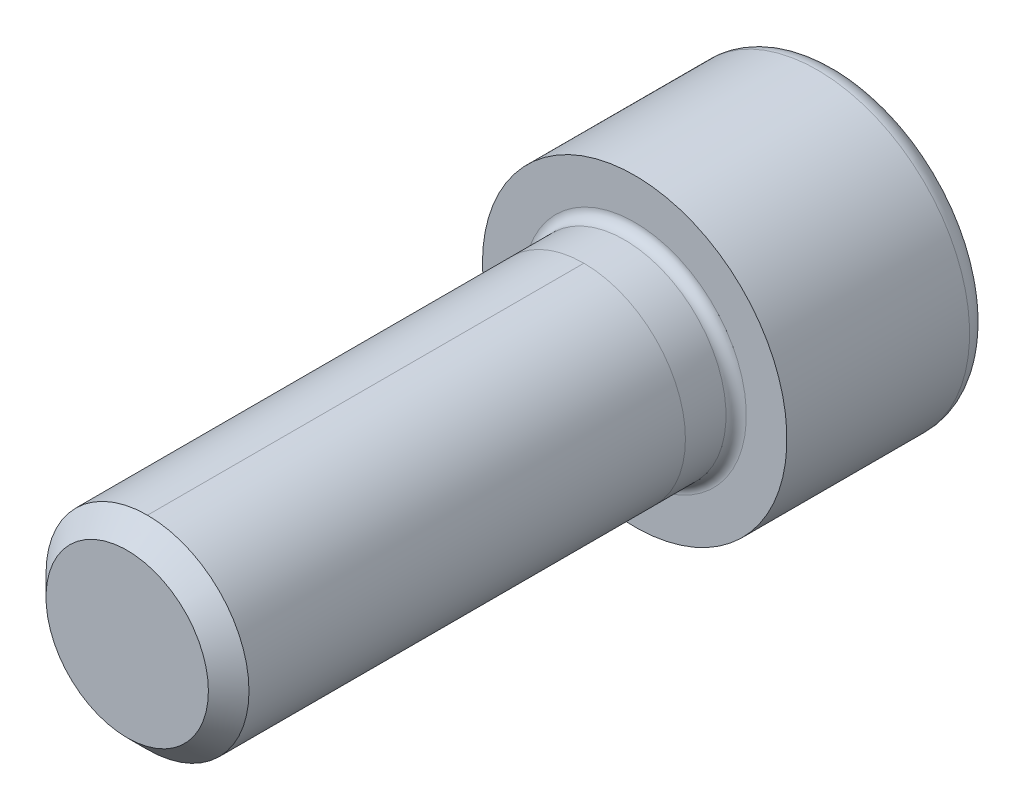
ISO-10303-21;
HEADER;
FILE_DESCRIPTION(('STEP AP214'),'2;1');
FILE_NAME('part.step','',(''),(''),'','','');
FILE_SCHEMA(('AUTOMOTIVE_DESIGN { 1 0 10303 214 1 1 1 1 }'));
ENDSEC;
DATA;
#1=APPLICATION_CONTEXT('core data for automotive mechanical design processes');
#2=APPLICATION_PROTOCOL_DEFINITION('international standard','automotive_design',2000,#1);
#3=PRODUCT_CONTEXT('',#1,'mechanical');
#4=PRODUCT('Part','Part','',(#3));
#5=PRODUCT_RELATED_PRODUCT_CATEGORY('part','',(#4));
#6=PRODUCT_DEFINITION_FORMATION('','',#4);
#7=PRODUCT_DEFINITION_CONTEXT('part definition',#1,'design');
#8=PRODUCT_DEFINITION('design','',#6,#7);
#9=PRODUCT_DEFINITION_SHAPE('','',#8);
#10=(LENGTH_UNIT() NAMED_UNIT(*) SI_UNIT(.MILLI.,.METRE.));
#11=(NAMED_UNIT(*) PLANE_ANGLE_UNIT() SI_UNIT($,.RADIAN.));
#12=(NAMED_UNIT(*) SI_UNIT($,.STERADIAN.) SOLID_ANGLE_UNIT());
#13=UNCERTAINTY_MEASURE_WITH_UNIT(LENGTH_MEASURE(1.E-05),#10,'distance_accuracy_value','');
#14=(GEOMETRIC_REPRESENTATION_CONTEXT(3) GLOBAL_UNCERTAINTY_ASSIGNED_CONTEXT((#13)) GLOBAL_UNIT_ASSIGNED_CONTEXT((#10,
#11,#12)) REPRESENTATION_CONTEXT('',''));
#15=CARTESIAN_POINT('',(0.,0.,0.));
#16=DIRECTION('',(0.,0.,1.));
#17=DIRECTION('',(1.,0.,0.));
#18=AXIS2_PLACEMENT_3D('',#15,#16,#17);
#19=CARTESIAN_POINT('',(0.,0.,30.));
#20=DIRECTION('',(0.,0.,-1.));
#21=DIRECTION('',(-1.,0.,0.));
#22=AXIS2_PLACEMENT_3D('',#19,#20,#21);
#23=CYLINDRICAL_SURFACE('',#22,6.);
#24=DIRECTION('',(0.,0.,-1.));
#25=VECTOR('',#24,1.);
#26=CARTESIAN_POINT('',(0.,6.,30.));
#27=LINE('',#26,#25);
#28=CARTESIAN_POINT('',(0.,6.,28.8));
#29=VERTEX_POINT('',#28);
#30=CARTESIAN_POINT('',(0.,6.,3.));
#31=VERTEX_POINT('',#30);
#32=EDGE_CURVE('E58',#29,#31,#27,.T.);
#33=ORIENTED_EDGE('',*,*,#32,.F.);
#34=CARTESIAN_POINT('',(0.,0.,28.8));
#35=DIRECTION('',(0.,0.,1.));
#36=DIRECTION('',(1.,0.,0.));
#37=AXIS2_PLACEMENT_3D('',#34,#35,#36);
#38=CIRCLE('',#37,6.);
#39=CARTESIAN_POINT('',(0.,-6.,28.8));
#40=VERTEX_POINT('',#39);
#41=EDGE_CURVE('E192',#29,#40,#38,.F.);
#42=ORIENTED_EDGE('',*,*,#41,.T.);
#43=DIRECTION('',(0.,0.,-1.));
#44=VECTOR('',#43,1.);
#45=CARTESIAN_POINT('',(0.,-6.00000000000001,30.));
#46=LINE('',#45,#44);
#47=CARTESIAN_POINT('',(0.,-6.00000000000001,3.00000000000001));
#48=VERTEX_POINT('',#47);
#49=EDGE_CURVE('E195',#40,#48,#46,.T.);
#50=ORIENTED_EDGE('',*,*,#49,.T.);
#51=CARTESIAN_POINT('',(0.,0.,3.));
#52=DIRECTION('',(0.,0.,1.));
#53=DIRECTION('',(0.,-1.,0.));
#54=AXIS2_PLACEMENT_3D('',#51,#52,#53);
#55=CIRCLE('',#54,6.);
#56=EDGE_CURVE('E64',#48,#31,#55,.T.);
#57=ORIENTED_EDGE('',*,*,#56,.T.);
#58=EDGE_LOOP('',(#33,#42,#50,#57));
#59=FACE_BOUND('',#58,.T.);
#60=ADVANCED_FACE('F43',(#59),#23,.T.);
#61=CARTESIAN_POINT('',(0.,0.,0.6));
#62=DIRECTION('',(0.,0.,-1.));
#63=DIRECTION('',(-1.,0.,0.));
#64=AXIS2_PLACEMENT_3D('',#61,#62,#63);
#65=CIRCLE('',#64,6.);
#66=CARTESIAN_POINT('',(-6.,0.,0.6));
#67=VERTEX_POINT('',#66);
#68=EDGE_CURVE('E12',#67,#67,#65,.F.);
#69=ORIENTED_EDGE('',*,*,#68,.T.);
#70=EDGE_LOOP('',(#69));
#71=FACE_BOUND('',#70,.T.);
#72=ORIENTED_EDGE('',*,*,#56,.F.);
#73=EDGE_CURVE('E217',#31,#48,#55,.T.);
#74=ORIENTED_EDGE('',*,*,#73,.F.);
#75=EDGE_LOOP('',(#72,#74));
#76=FACE_BOUND('',#75,.T.);
#77=ADVANCED_FACE('F235',(#71,#76),#23,.T.);
#78=EDGE_CURVE('E193',#40,#29,#38,.F.);
#79=ORIENTED_EDGE('',*,*,#78,.T.);
#80=ORIENTED_EDGE('',*,*,#32,.T.);
#81=ORIENTED_EDGE('',*,*,#73,.T.);
#82=ORIENTED_EDGE('',*,*,#49,.F.);
#83=EDGE_LOOP('',(#79,#80,#81,#82));
#84=FACE_BOUND('',#83,.T.);
#85=ADVANCED_FACE('F238',(#84),#23,.T.);
#86=CARTESIAN_POINT('',(0.,0.,30.));
#87=DIRECTION('',(0.,0.,1.));
#88=DIRECTION('',(1.,0.,0.));
#89=AXIS2_PLACEMENT_3D('',#86,#87,#88);
#90=PLANE('',#89);
#91=CARTESIAN_POINT('',(0.,0.,30.));
#92=DIRECTION('',(0.,0.,1.));
#93=DIRECTION('',(1.,0.,0.));
#94=AXIS2_PLACEMENT_3D('',#91,#92,#93);
#95=CIRCLE('',#94,4.79999999999999);
#96=CARTESIAN_POINT('',(4.79999999999999,0.,30.));
#97=VERTEX_POINT('',#96);
#98=EDGE_CURVE('E189',#97,#97,#95,.T.);
#99=ORIENTED_EDGE('',*,*,#98,.T.);
#100=EDGE_LOOP('',(#99));
#101=FACE_BOUND('',#100,.T.);
#102=ADVANCED_FACE('F246',(#101),#90,.T.);
#103=CARTESIAN_POINT('',(0.,0.,0.));
#104=DIRECTION('',(0.,0.,-1.));
#105=DIRECTION('',(-1.,0.,0.));
#106=AXIS2_PLACEMENT_3D('',#103,#104,#105);
#107=PLANE('',#106);
#108=CARTESIAN_POINT('',(0.,0.,0.));
#109=DIRECTION('',(0.,0.,-1.));
#110=DIRECTION('',(-1.,0.,0.));
#111=AXIS2_PLACEMENT_3D('',#108,#109,#110);
#112=CIRCLE('',#111,6.6);
#113=CARTESIAN_POINT('',(-6.6,0.,0.));
#114=VERTEX_POINT('',#113);
#115=EDGE_CURVE('E51',#114,#114,#112,.T.);
#116=ORIENTED_EDGE('',*,*,#115,.T.);
#117=EDGE_LOOP('',(#116));
#118=FACE_BOUND('',#117,.T.);
#119=CARTESIAN_POINT('',(0.,0.,0.));
#120=DIRECTION('',(0.,0.,-1.));
#121=DIRECTION('',(-1.,0.,0.));
#122=AXIS2_PLACEMENT_3D('',#119,#120,#121);
#123=CIRCLE('',#122,9.);
#124=CARTESIAN_POINT('',(-9.,0.,0.));
#125=VERTEX_POINT('',#124);
#126=EDGE_CURVE('E179',#125,#125,#123,.T.);
#127=ORIENTED_EDGE('',*,*,#126,.F.);
#128=EDGE_LOOP('',(#127));
#129=FACE_BOUND('',#128,.T.);
#130=ADVANCED_FACE('F224',(#118,#129),#107,.F.);
#131=CARTESIAN_POINT('',(0.,0.,-12.));
#132=DIRECTION('',(0.,0.,1.));
#133=DIRECTION('',(1.,0.,0.));
#134=AXIS2_PLACEMENT_3D('',#131,#132,#133);
#135=CYLINDRICAL_SURFACE('',#134,9.);
#136=CARTESIAN_POINT('',(0.,0.,-10.8));
#137=DIRECTION('',(0.,0.,-1.));
#138=DIRECTION('',(-1.,0.,0.));
#139=AXIS2_PLACEMENT_3D('',#136,#137,#138);
#140=CIRCLE('',#139,9.);
#141=CARTESIAN_POINT('',(-9.,0.,-10.8));
#142=VERTEX_POINT('',#141);
#143=EDGE_CURVE('E186',#142,#142,#140,.F.);
#144=ORIENTED_EDGE('',*,*,#143,.T.);
#145=EDGE_LOOP('',(#144));
#146=FACE_BOUND('',#145,.T.);
#147=ORIENTED_EDGE('',*,*,#126,.T.);
#148=EDGE_LOOP('',(#147));
#149=FACE_BOUND('',#148,.T.);
#150=ADVANCED_FACE('F282',(#146,#149),#135,.T.);
#151=CARTESIAN_POINT('',(0.,0.,-12.));
#152=DIRECTION('',(0.,0.,-1.));
#153=DIRECTION('',(-1.,0.,0.));
#154=AXIS2_PLACEMENT_3D('',#151,#152,#153);
#155=PLANE('',#154);
#156=DIRECTION('',(0.5,-0.866025403784439,0.));
#157=VECTOR('',#156,1.);
#158=CARTESIAN_POINT('',(2.88675134594813,5.,-12.));
#159=LINE('',#158,#157);
#160=CARTESIAN_POINT('',(2.88675134594813,5.,-12.));
#161=VERTEX_POINT('',#160);
#162=CARTESIAN_POINT('',(5.77350269189626,0.,-12.));
#163=VERTEX_POINT('',#162);
#164=EDGE_CURVE('E122',#161,#163,#159,.T.);
#165=ORIENTED_EDGE('',*,*,#164,.F.);
#166=DIRECTION('',(1.,0.,0.));
#167=VECTOR('',#166,1.);
#168=CARTESIAN_POINT('',(-2.88675134594813,5.,-12.));
#169=LINE('',#168,#167);
#170=CARTESIAN_POINT('',(-2.88675134594813,5.,-12.));
#171=VERTEX_POINT('',#170);
#172=EDGE_CURVE('E176',#171,#161,#169,.T.);
#173=ORIENTED_EDGE('',*,*,#172,.F.);
#174=DIRECTION('',(0.5,0.866025403784439,0.));
#175=VECTOR('',#174,1.);
#176=CARTESIAN_POINT('',(-5.77350269189626,0.,-12.));
#177=LINE('',#176,#175);
#178=CARTESIAN_POINT('',(-5.77350269189626,0.,-12.));
#179=VERTEX_POINT('',#178);
#180=EDGE_CURVE('E173',#179,#171,#177,.T.);
#181=ORIENTED_EDGE('',*,*,#180,.F.);
#182=DIRECTION('',(-0.5,0.866025403784439,0.));
#183=VECTOR('',#182,1.);
#184=CARTESIAN_POINT('',(-2.88675134594813,-5.,-12.));
#185=LINE('',#184,#183);
#186=CARTESIAN_POINT('',(-2.88675134594813,-5.,-12.));
#187=VERTEX_POINT('',#186);
#188=EDGE_CURVE('E170',#187,#179,#185,.T.);
#189=ORIENTED_EDGE('',*,*,#188,.F.);
#190=DIRECTION('',(-1.,0.,0.));
#191=VECTOR('',#190,1.);
#192=CARTESIAN_POINT('',(2.88675134594813,-5.,-12.));
#193=LINE('',#192,#191);
#194=CARTESIAN_POINT('',(2.88675134594813,-5.,-12.));
#195=VERTEX_POINT('',#194);
#196=EDGE_CURVE('E167',#195,#187,#193,.T.);
#197=ORIENTED_EDGE('',*,*,#196,.F.);
#198=DIRECTION('',(-0.5,-0.866025403784439,0.));
#199=VECTOR('',#198,1.);
#200=CARTESIAN_POINT('',(5.77350269189626,0.,-12.));
#201=LINE('',#200,#199);
#202=EDGE_CURVE('E164',#163,#195,#201,.T.);
#203=ORIENTED_EDGE('',*,*,#202,.F.);
#204=EDGE_LOOP('',(#165,#173,#181,#189,#197,#203));
#205=FACE_BOUND('',#204,.T.);
#206=CARTESIAN_POINT('',(0.,0.,-12.));
#207=DIRECTION('',(0.,0.,-1.));
#208=DIRECTION('',(-1.,0.,0.));
#209=AXIS2_PLACEMENT_3D('',#206,#207,#208);
#210=CIRCLE('',#209,7.8);
#211=CARTESIAN_POINT('',(-7.8,0.,-12.));
#212=VERTEX_POINT('',#211);
#213=EDGE_CURVE('E182',#212,#212,#210,.T.);
#214=ORIENTED_EDGE('',*,*,#213,.T.);
#215=EDGE_LOOP('',(#214));
#216=FACE_BOUND('',#215,.T.);
#217=ADVANCED_FACE('F277',(#205,#216),#155,.T.);
#218=CARTESIAN_POINT('',(0.,0.,-10.8));
#219=DIRECTION('',(0.,0.,-1.));
#220=DIRECTION('',(-1.,0.,0.));
#221=AXIS2_PLACEMENT_3D('',#218,#219,#220);
#222=TOROIDAL_SURFACE('',#221,7.8,1.2);
#223=ORIENTED_EDGE('',*,*,#143,.F.);
#224=EDGE_LOOP('',(#223));
#225=FACE_BOUND('',#224,.T.);
#226=ORIENTED_EDGE('',*,*,#213,.F.);
#227=EDGE_LOOP('',(#226));
#228=FACE_BOUND('',#227,.T.);
#229=ADVANCED_FACE('F268',(#225,#228),#222,.T.);
#230=CARTESIAN_POINT('',(0.,0.,30.));
#231=DIRECTION('',(0.,0.,-1.));
#232=DIRECTION('',(-1.,0.,0.));
#233=AXIS2_PLACEMENT_3D('',#230,#231,#232);
#234=CONICAL_SURFACE('',#233,4.79999999999999,0.785398163397447);
#235=ORIENTED_EDGE('',*,*,#78,.F.);
#236=ORIENTED_EDGE('',*,*,#41,.F.);
#237=EDGE_LOOP('',(#235,#236));
#238=FACE_BOUND('',#237,.T.);
#239=ORIENTED_EDGE('',*,*,#98,.F.);
#240=EDGE_LOOP('',(#239));
#241=FACE_BOUND('',#240,.T.);
#242=ADVANCED_FACE('F255',(#238,#241),#234,.T.);
#243=CARTESIAN_POINT('',(2.88675134594813,5.,-7.55555555555556));
#244=DIRECTION('',(0.866025403784439,0.5,0.));
#245=DIRECTION('',(-0.5,0.866025403784439,0.));
#246=AXIS2_PLACEMENT_3D('',#243,#244,#245);
#247=PLANE('',#246);
#248=ORIENTED_EDGE('',*,*,#164,.T.);
#249=DIRECTION('',(0.,0.,-1.));
#250=VECTOR('',#249,1.);
#251=CARTESIAN_POINT('',(5.77350269189626,0.,-7.55555555555556));
#252=LINE('',#251,#250);
#253=CARTESIAN_POINT('',(5.77350269189626,0.,-7.55555555555556));
#254=VERTEX_POINT('',#253);
#255=EDGE_CURVE('E200',#254,#163,#252,.T.);
#256=ORIENTED_EDGE('',*,*,#255,.F.);
#257=DIRECTION('',(-0.5,0.866025403784439,0.));
#258=VECTOR('',#257,1.);
#259=CARTESIAN_POINT('',(5.77350269189626,0.,-7.55555555555556));
#260=LINE('',#259,#258);
#261=CARTESIAN_POINT('',(2.88675134594813,5.,-7.55555555555556));
#262=VERTEX_POINT('',#261);
#263=EDGE_CURVE('E117',#262,#254,#260,.F.);
#264=ORIENTED_EDGE('',*,*,#263,.F.);
#265=DIRECTION('',(0.,0.,-1.));
#266=VECTOR('',#265,1.);
#267=CARTESIAN_POINT('',(2.88675134594813,5.,-7.55555555555556));
#268=LINE('',#267,#266);
#269=EDGE_CURVE('E183',#262,#161,#268,.T.);
#270=ORIENTED_EDGE('',*,*,#269,.T.);
#271=EDGE_LOOP('',(#248,#256,#264,#270));
#272=FACE_BOUND('',#271,.T.);
#273=ADVANCED_FACE('F267',(#272),#247,.F.);
#274=CARTESIAN_POINT('',(-2.88675134594813,5.,-7.55555555555556));
#275=DIRECTION('',(0.,1.,0.));
#276=DIRECTION('',(-1.,0.,0.));
#277=AXIS2_PLACEMENT_3D('',#274,#275,#276);
#278=PLANE('',#277);
#279=ORIENTED_EDGE('',*,*,#172,.T.);
#280=ORIENTED_EDGE('',*,*,#269,.F.);
#281=DIRECTION('',(1.,0.,0.));
#282=VECTOR('',#281,1.);
#283=CARTESIAN_POINT('',(0.,5.,-7.55555555555556));
#284=LINE('',#283,#282);
#285=CARTESIAN_POINT('',(-2.88675134594813,5.,-7.55555555555556));
#286=VERTEX_POINT('',#285);
#287=EDGE_CURVE('E131',#286,#262,#284,.T.);
#288=ORIENTED_EDGE('',*,*,#287,.F.);
#289=DIRECTION('',(0.,0.,-1.));
#290=VECTOR('',#289,1.);
#291=CARTESIAN_POINT('',(-2.88675134594813,5.,-7.55555555555556));
#292=LINE('',#291,#290);
#293=EDGE_CURVE('E196',#286,#171,#292,.T.);
#294=ORIENTED_EDGE('',*,*,#293,.T.);
#295=EDGE_LOOP('',(#279,#280,#288,#294));
#296=FACE_BOUND('',#295,.T.);
#297=ADVANCED_FACE('F274',(#296),#278,.F.);
#298=CARTESIAN_POINT('',(-5.77350269189626,0.,-7.55555555555556));
#299=DIRECTION('',(-0.866025403784439,0.5,0.));
#300=DIRECTION('',(-0.5,-0.866025403784439,0.));
#301=AXIS2_PLACEMENT_3D('',#298,#299,#300);
#302=PLANE('',#301);
#303=ORIENTED_EDGE('',*,*,#180,.T.);
#304=ORIENTED_EDGE('',*,*,#293,.F.);
#305=DIRECTION('',(-0.5,-0.866025403784439,0.));
#306=VECTOR('',#305,1.);
#307=CARTESIAN_POINT('',(-2.88675134594813,5.,-7.55555555555556));
#308=LINE('',#307,#306);
#309=CARTESIAN_POINT('',(-5.77350269189626,0.,-7.55555555555556));
#310=VERTEX_POINT('',#309);
#311=EDGE_CURVE('E139',#310,#286,#308,.F.);
#312=ORIENTED_EDGE('',*,*,#311,.F.);
#313=DIRECTION('',(0.,0.,-1.));
#314=VECTOR('',#313,1.);
#315=CARTESIAN_POINT('',(-5.77350269189626,0.,-7.55555555555556));
#316=LINE('',#315,#314);
#317=EDGE_CURVE('E198',#310,#179,#316,.T.);
#318=ORIENTED_EDGE('',*,*,#317,.T.);
#319=EDGE_LOOP('',(#303,#304,#312,#318));
#320=FACE_BOUND('',#319,.T.);
#321=ADVANCED_FACE('F310',(#320),#302,.F.);
#322=CARTESIAN_POINT('',(-2.88675134594813,-5.,-7.55555555555556));
#323=DIRECTION('',(-0.866025403784439,-0.5,0.));
#324=DIRECTION('',(0.5,-0.866025403784439,0.));
#325=AXIS2_PLACEMENT_3D('',#322,#323,#324);
#326=PLANE('',#325);
#327=ORIENTED_EDGE('',*,*,#188,.T.);
#328=ORIENTED_EDGE('',*,*,#317,.F.);
#329=DIRECTION('',(0.5,-0.866025403784439,0.));
#330=VECTOR('',#329,1.);
#331=CARTESIAN_POINT('',(-5.77350269189626,0.,-7.55555555555556));
#332=LINE('',#331,#330);
#333=CARTESIAN_POINT('',(-2.88675134594813,-5.,-7.55555555555556));
#334=VERTEX_POINT('',#333);
#335=EDGE_CURVE('E147',#334,#310,#332,.F.);
#336=ORIENTED_EDGE('',*,*,#335,.F.);
#337=DIRECTION('',(0.,0.,-1.));
#338=VECTOR('',#337,1.);
#339=CARTESIAN_POINT('',(-2.88675134594813,-5.,-7.55555555555556));
#340=LINE('',#339,#338);
#341=EDGE_CURVE('E205',#334,#187,#340,.T.);
#342=ORIENTED_EDGE('',*,*,#341,.T.);
#343=EDGE_LOOP('',(#327,#328,#336,#342));
#344=FACE_BOUND('',#343,.T.);
#345=ADVANCED_FACE('F306',(#344),#326,.F.);
#346=CARTESIAN_POINT('',(2.88675134594813,-5.,-7.55555555555556));
#347=DIRECTION('',(0.,-1.,0.));
#348=DIRECTION('',(1.,0.,0.));
#349=AXIS2_PLACEMENT_3D('',#346,#347,#348);
#350=PLANE('',#349);
#351=ORIENTED_EDGE('',*,*,#196,.T.);
#352=ORIENTED_EDGE('',*,*,#341,.F.);
#353=DIRECTION('',(1.,0.,0.));
#354=VECTOR('',#353,1.);
#355=CARTESIAN_POINT('',(0.,-5.,-7.55555555555556));
#356=LINE('',#355,#354);
#357=CARTESIAN_POINT('',(2.88675134594813,-5.,-7.55555555555556));
#358=VERTEX_POINT('',#357);
#359=EDGE_CURVE('E154',#358,#334,#356,.F.);
#360=ORIENTED_EDGE('',*,*,#359,.F.);
#361=DIRECTION('',(0.,0.,-1.));
#362=VECTOR('',#361,1.);
#363=CARTESIAN_POINT('',(2.88675134594813,-5.,-7.55555555555556));
#364=LINE('',#363,#362);
#365=EDGE_CURVE('E203',#358,#195,#364,.T.);
#366=ORIENTED_EDGE('',*,*,#365,.T.);
#367=EDGE_LOOP('',(#351,#352,#360,#366));
#368=FACE_BOUND('',#367,.T.);
#369=ADVANCED_FACE('F302',(#368),#350,.F.);
#370=CARTESIAN_POINT('',(5.77350269189626,0.,-7.55555555555556));
#371=DIRECTION('',(0.866025403784439,-0.5,0.));
#372=DIRECTION('',(0.5,0.866025403784439,0.));
#373=AXIS2_PLACEMENT_3D('',#370,#371,#372);
#374=PLANE('',#373);
#375=ORIENTED_EDGE('',*,*,#202,.T.);
#376=ORIENTED_EDGE('',*,*,#365,.F.);
#377=DIRECTION('',(0.5,0.866025403784439,0.));
#378=VECTOR('',#377,1.);
#379=CARTESIAN_POINT('',(2.88675134594813,-5.00000000000001,-7.55555555555556));
#380=LINE('',#379,#378);
#381=EDGE_CURVE('E159',#254,#358,#380,.F.);
#382=ORIENTED_EDGE('',*,*,#381,.F.);
#383=ORIENTED_EDGE('',*,*,#255,.T.);
#384=EDGE_LOOP('',(#375,#376,#382,#383));
#385=FACE_BOUND('',#384,.T.);
#386=ADVANCED_FACE('F299',(#385),#374,.F.);
#387=CARTESIAN_POINT('',(-1.57942379646789,-0.911880754055239,-5.12932924156072));
#388=DIRECTION('',(0.290126882702444,0.167504833827403,0.942214690279141));
#389=DIRECTION('',(0.955717783517745,0.,-0.294284757111084));
#390=AXIS2_PLACEMENT_3D('',#387,#388,#389);
#391=PLANE('',#390);
#392=DIRECTION('',(-0.477858891758872,-0.827675879374923,0.294284757111084));
#393=VECTOR('',#392,1.);
#394=CARTESIAN_POINT('',(2.88675134594813,5.,-7.55555555555556));
#395=LINE('',#394,#393);
#396=CARTESIAN_POINT('',(0.,0.,-5.77777777777778));
#397=VERTEX_POINT('',#396);
#398=EDGE_CURVE('E114',#262,#397,#395,.T.);
#399=ORIENTED_EDGE('',*,*,#398,.F.);
#400=ORIENTED_EDGE('',*,*,#263,.T.);
#401=DIRECTION('',(-0.955717783517745,0.,0.294284757111084));
#402=VECTOR('',#401,1.);
#403=CARTESIAN_POINT('',(5.77350269189626,0.,-7.55555555555556));
#404=LINE('',#403,#402);
#405=EDGE_CURVE('E111',#254,#397,#404,.T.);
#406=ORIENTED_EDGE('',*,*,#405,.T.);
#407=EDGE_LOOP('',(#399,#400,#406));
#408=FACE_BOUND('',#407,.T.);
#409=ADVANCED_FACE('F113',(#408),#391,.F.);
#410=CARTESIAN_POINT('',(-1.57942379646789,0.911880754055239,-5.12932924156072));
#411=DIRECTION('',(0.290126882702444,-0.167504833827403,0.942214690279141));
#412=DIRECTION('',(0.955717783517745,0.,-0.294284757111084));
#413=AXIS2_PLACEMENT_3D('',#410,#411,#412);
#414=PLANE('',#413);
#415=ORIENTED_EDGE('',*,*,#405,.F.);
#416=ORIENTED_EDGE('',*,*,#381,.T.);
#417=DIRECTION('',(-0.477858891758872,0.827675879374923,0.294284757111084));
#418=VECTOR('',#417,1.);
#419=CARTESIAN_POINT('',(2.88675134594813,-5.,-7.55555555555556));
#420=LINE('',#419,#418);
#421=EDGE_CURVE('E152',#358,#397,#420,.T.);
#422=ORIENTED_EDGE('',*,*,#421,.T.);
#423=EDGE_LOOP('',(#415,#416,#422));
#424=FACE_BOUND('',#423,.T.);
#425=ADVANCED_FACE('F157',(#424),#414,.F.);
#426=CARTESIAN_POINT('',(0.,-1.82376150811048,-5.12932924156072));
#427=DIRECTION('',(0.,0.335009667654806,0.942214690279141));
#428=DIRECTION('',(0.,-0.942214690279141,0.335009667654806));
#429=AXIS2_PLACEMENT_3D('',#426,#427,#428);
#430=PLANE('',#429);
#431=DIRECTION('',(0.477858891758872,-0.827675879374923,0.294284757111084));
#432=VECTOR('',#431,1.);
#433=CARTESIAN_POINT('',(-2.88675134594813,5.,-7.55555555555556));
#434=LINE('',#433,#432);
#435=EDGE_CURVE('E128',#286,#397,#434,.T.);
#436=ORIENTED_EDGE('',*,*,#435,.F.);
#437=ORIENTED_EDGE('',*,*,#287,.T.);
#438=ORIENTED_EDGE('',*,*,#398,.T.);
#439=EDGE_LOOP('',(#436,#437,#438));
#440=FACE_BOUND('',#439,.T.);
#441=ADVANCED_FACE('F127',(#440),#430,.F.);
#442=CARTESIAN_POINT('',(1.57942379646789,-0.911880754055239,-5.12932924156072));
#443=DIRECTION('',(-0.290126882702444,0.167504833827403,0.942214690279141));
#444=DIRECTION('',(0.955717783517744,0.,0.294284757111084));
#445=AXIS2_PLACEMENT_3D('',#442,#443,#444);
#446=PLANE('',#445);
#447=DIRECTION('',(0.955717783517745,0.,0.294284757111084));
#448=VECTOR('',#447,1.);
#449=CARTESIAN_POINT('',(-5.77350269189626,0.,-7.55555555555556));
#450=LINE('',#449,#448);
#451=EDGE_CURVE('E136',#310,#397,#450,.T.);
#452=ORIENTED_EDGE('',*,*,#451,.F.);
#453=ORIENTED_EDGE('',*,*,#311,.T.);
#454=ORIENTED_EDGE('',*,*,#435,.T.);
#455=EDGE_LOOP('',(#452,#453,#454));
#456=FACE_BOUND('',#455,.T.);
#457=ADVANCED_FACE('F135',(#456),#446,.F.);
#458=CARTESIAN_POINT('',(1.57942379646789,0.911880754055239,-5.12932924156072));
#459=DIRECTION('',(-0.290126882702444,-0.167504833827403,0.942214690279141));
#460=DIRECTION('',(0.955717783517744,0.,0.294284757111084));
#461=AXIS2_PLACEMENT_3D('',#458,#459,#460);
#462=PLANE('',#461);
#463=DIRECTION('',(0.477858891758872,0.827675879374923,0.294284757111084));
#464=VECTOR('',#463,1.);
#465=CARTESIAN_POINT('',(-2.88675134594813,-5.,-7.55555555555556));
#466=LINE('',#465,#464);
#467=EDGE_CURVE('E144',#334,#397,#466,.T.);
#468=ORIENTED_EDGE('',*,*,#467,.F.);
#469=ORIENTED_EDGE('',*,*,#335,.T.);
#470=ORIENTED_EDGE('',*,*,#451,.T.);
#471=EDGE_LOOP('',(#468,#469,#470));
#472=FACE_BOUND('',#471,.T.);
#473=ADVANCED_FACE('F143',(#472),#462,.F.);
#474=CARTESIAN_POINT('',(0.,1.82376150811048,-5.12932924156072));
#475=DIRECTION('',(0.,-0.335009667654806,0.942214690279141));
#476=DIRECTION('',(0.,-0.942214690279141,-0.335009667654806));
#477=AXIS2_PLACEMENT_3D('',#474,#475,#476);
#478=PLANE('',#477);
#479=ORIENTED_EDGE('',*,*,#421,.F.);
#480=ORIENTED_EDGE('',*,*,#359,.T.);
#481=ORIENTED_EDGE('',*,*,#467,.T.);
#482=EDGE_LOOP('',(#479,#480,#481));
#483=FACE_BOUND('',#482,.T.);
#484=ADVANCED_FACE('F151',(#483),#478,.F.);
#485=CARTESIAN_POINT('',(0.,0.,0.6));
#486=DIRECTION('',(0.,0.,-1.));
#487=DIRECTION('',(-1.,0.,0.));
#488=AXIS2_PLACEMENT_3D('',#485,#486,#487);
#489=TOROIDAL_SURFACE('',#488,6.6,0.6);
#490=ORIENTED_EDGE('',*,*,#68,.F.);
#491=EDGE_LOOP('',(#490));
#492=FACE_BOUND('',#491,.T.);
#493=ORIENTED_EDGE('',*,*,#115,.F.);
#494=EDGE_LOOP('',(#493));
#495=FACE_BOUND('',#494,.T.);
#496=ADVANCED_FACE('F45',(#492,#495),#489,.F.);
#497=CLOSED_SHELL('',(#60,#77,#85,#102,#130,#150,#217,#229,#242,#273,#297,#321,#345,#369,#386,
#409,#425,#441,#457,#473,#484,#496));
#498=MANIFOLD_SOLID_BREP('B2',#497);
#499=ADVANCED_BREP_SHAPE_REPRESENTATION('',(#18,#498),#14);
#500=SHAPE_DEFINITION_REPRESENTATION(#9,#499);
ENDSEC;
END-ISO-10303-21;
